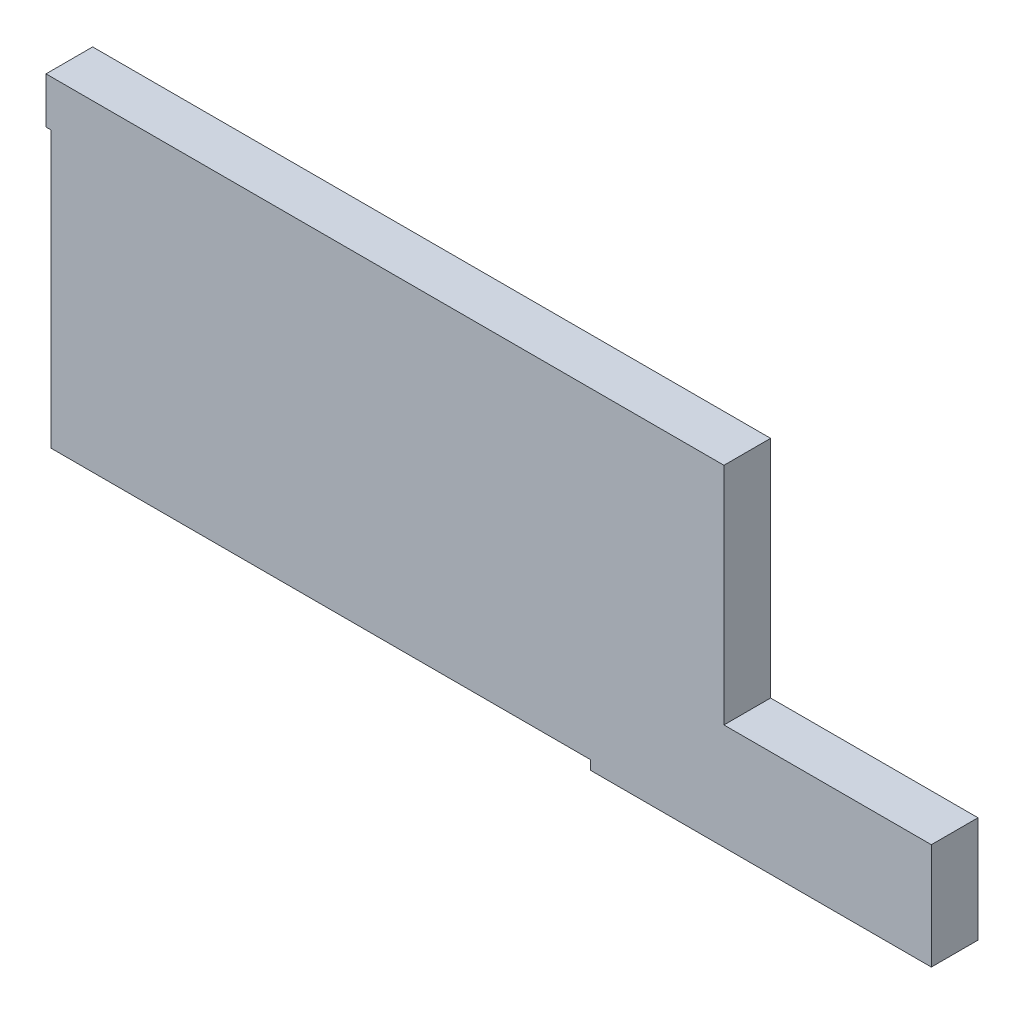
ISO-10303-21;
HEADER;
FILE_DESCRIPTION(('STEP AP214'),'2;1');
FILE_NAME('part.step','',(''),(''),'','','');
FILE_SCHEMA(('AUTOMOTIVE_DESIGN { 1 0 10303 214 1 1 1 1 }'));
ENDSEC;
DATA;
#1=APPLICATION_CONTEXT('core data for automotive mechanical design processes');
#2=APPLICATION_PROTOCOL_DEFINITION('international standard','automotive_design',2000,#1);
#3=PRODUCT_CONTEXT('',#1,'mechanical');
#4=PRODUCT('Part','Part','',(#3));
#5=PRODUCT_RELATED_PRODUCT_CATEGORY('part','',(#4));
#6=PRODUCT_DEFINITION_FORMATION('','',#4);
#7=PRODUCT_DEFINITION_CONTEXT('part definition',#1,'design');
#8=PRODUCT_DEFINITION('design','',#6,#7);
#9=PRODUCT_DEFINITION_SHAPE('','',#8);
#10=(LENGTH_UNIT() NAMED_UNIT(*) SI_UNIT(.MILLI.,.METRE.));
#11=(NAMED_UNIT(*) PLANE_ANGLE_UNIT() SI_UNIT($,.RADIAN.));
#12=(NAMED_UNIT(*) SI_UNIT($,.STERADIAN.) SOLID_ANGLE_UNIT());
#13=UNCERTAINTY_MEASURE_WITH_UNIT(LENGTH_MEASURE(1.E-05),#10,'distance_accuracy_value','');
#14=(GEOMETRIC_REPRESENTATION_CONTEXT(3) GLOBAL_UNCERTAINTY_ASSIGNED_CONTEXT((#13)) GLOBAL_UNIT_ASSIGNED_CONTEXT((#10,
#11,#12)) REPRESENTATION_CONTEXT('',''));
#15=CARTESIAN_POINT('',(0.,0.,0.));
#16=DIRECTION('',(0.,0.,1.));
#17=DIRECTION('',(1.,0.,0.));
#18=AXIS2_PLACEMENT_3D('',#15,#16,#17);
#19=CARTESIAN_POINT('',(146.,-14.1960000000021,-10.125));
#20=DIRECTION('',(0.,1.,0.));
#21=DIRECTION('',(-1.,0.,0.));
#22=AXIS2_PLACEMENT_3D('',#19,#20,#21);
#23=PLANE('',#22);
#24=DIRECTION('',(-1.,0.,0.));
#25=VECTOR('',#24,1.);
#26=CARTESIAN_POINT('',(146.,-14.1960000000021,0.));
#27=LINE('',#26,#25);
#28=CARTESIAN_POINT('',(191.,-14.1960000000021,0.));
#29=VERTEX_POINT('',#28);
#30=CARTESIAN_POINT('',(146.,-14.1960000000021,0.));
#31=VERTEX_POINT('',#30);
#32=EDGE_CURVE('E142',#29,#31,#27,.T.);
#33=ORIENTED_EDGE('',*,*,#32,.F.);
#34=DIRECTION('',(0.,0.,1.));
#35=VECTOR('',#34,1.);
#36=CARTESIAN_POINT('',(191.,-14.1960000000021,-10.125));
#37=LINE('',#36,#35);
#38=CARTESIAN_POINT('',(191.,-14.1960000000021,-10.125));
#39=VERTEX_POINT('',#38);
#40=EDGE_CURVE('E11',#39,#29,#37,.T.);
#41=ORIENTED_EDGE('',*,*,#40,.F.);
#42=DIRECTION('',(-1.,0.,0.));
#43=VECTOR('',#42,1.);
#44=CARTESIAN_POINT('',(146.,-14.1960000000021,-10.125));
#45=LINE('',#44,#43);
#46=CARTESIAN_POINT('',(146.,-14.1960000000021,-10.125));
#47=VERTEX_POINT('',#46);
#48=EDGE_CURVE('E168',#39,#47,#45,.T.);
#49=ORIENTED_EDGE('',*,*,#48,.T.);
#50=DIRECTION('',(0.,0.,1.));
#51=VECTOR('',#50,1.);
#52=CARTESIAN_POINT('',(146.,-14.1960000000021,-10.125));
#53=LINE('',#52,#51);
#54=EDGE_CURVE('E36',#47,#31,#53,.T.);
#55=ORIENTED_EDGE('',*,*,#54,.T.);
#56=EDGE_LOOP('',(#33,#41,#49,#55));
#57=FACE_BOUND('',#56,.T.);
#58=ADVANCED_FACE('F33',(#57),#23,.T.);
#59=CARTESIAN_POINT('',(191.,-14.1960000000021,-10.125));
#60=DIRECTION('',(1.,0.,0.));
#61=DIRECTION('',(0.,0.,-1.));
#62=AXIS2_PLACEMENT_3D('',#59,#60,#61);
#63=PLANE('',#62);
#64=DIRECTION('',(0.,1.,0.));
#65=VECTOR('',#64,1.);
#66=CARTESIAN_POINT('',(191.,-14.1960000000021,0.));
#67=LINE('',#66,#65);
#68=CARTESIAN_POINT('',(191.,-37.1960000000021,0.));
#69=VERTEX_POINT('',#68);
#70=EDGE_CURVE('E166',#69,#29,#67,.T.);
#71=ORIENTED_EDGE('',*,*,#70,.F.);
#72=DIRECTION('',(0.,0.,1.));
#73=VECTOR('',#72,1.);
#74=CARTESIAN_POINT('',(191.,-37.1960000000021,-10.125));
#75=LINE('',#74,#73);
#76=CARTESIAN_POINT('',(191.,-37.1960000000021,-10.125));
#77=VERTEX_POINT('',#76);
#78=EDGE_CURVE('E42',#77,#69,#75,.T.);
#79=ORIENTED_EDGE('',*,*,#78,.F.);
#80=DIRECTION('',(0.,1.,0.));
#81=VECTOR('',#80,1.);
#82=CARTESIAN_POINT('',(191.,-14.1960000000021,-10.125));
#83=LINE('',#82,#81);
#84=EDGE_CURVE('E132',#77,#39,#83,.T.);
#85=ORIENTED_EDGE('',*,*,#84,.T.);
#86=ORIENTED_EDGE('',*,*,#40,.T.);
#87=EDGE_LOOP('',(#71,#79,#85,#86));
#88=FACE_BOUND('',#87,.T.);
#89=ADVANCED_FACE('F184',(#88),#63,.T.);
#90=CARTESIAN_POINT('',(191.,-37.1960000000021,-10.125));
#91=DIRECTION('',(0.,-1.,0.));
#92=DIRECTION('',(0.,0.,-1.));
#93=AXIS2_PLACEMENT_3D('',#90,#91,#92);
#94=PLANE('',#93);
#95=DIRECTION('',(1.,0.,0.));
#96=VECTOR('',#95,1.);
#97=CARTESIAN_POINT('',(191.,-37.1960000000021,0.));
#98=LINE('',#97,#96);
#99=CARTESIAN_POINT('',(117.,-37.1960000000021,0.));
#100=VERTEX_POINT('',#99);
#101=EDGE_CURVE('E119',#100,#69,#98,.T.);
#102=ORIENTED_EDGE('',*,*,#101,.F.);
#103=DIRECTION('',(0.,0.,1.));
#104=VECTOR('',#103,1.);
#105=CARTESIAN_POINT('',(117.,-37.1960000000021,-10.125));
#106=LINE('',#105,#104);
#107=CARTESIAN_POINT('',(117.,-37.1960000000021,-10.125));
#108=VERTEX_POINT('',#107);
#109=EDGE_CURVE('E114',#108,#100,#106,.T.);
#110=ORIENTED_EDGE('',*,*,#109,.F.);
#111=DIRECTION('',(1.,0.,0.));
#112=VECTOR('',#111,1.);
#113=CARTESIAN_POINT('',(191.,-37.1960000000021,-10.125));
#114=LINE('',#113,#112);
#115=EDGE_CURVE('E117',#108,#77,#114,.T.);
#116=ORIENTED_EDGE('',*,*,#115,.T.);
#117=ORIENTED_EDGE('',*,*,#78,.T.);
#118=EDGE_LOOP('',(#102,#110,#116,#117));
#119=FACE_BOUND('',#118,.T.);
#120=ADVANCED_FACE('F116',(#119),#94,.T.);
#121=CARTESIAN_POINT('',(117.,-37.1960000000021,-10.125));
#122=DIRECTION('',(-1.,0.,0.));
#123=DIRECTION('',(0.,0.,1.));
#124=AXIS2_PLACEMENT_3D('',#121,#122,#123);
#125=PLANE('',#124);
#126=DIRECTION('',(0.,-1.,0.));
#127=VECTOR('',#126,1.);
#128=CARTESIAN_POINT('',(117.,-37.1960000000021,0.));
#129=LINE('',#128,#127);
#130=CARTESIAN_POINT('',(117.,-35.1960000000021,0.));
#131=VERTEX_POINT('',#130);
#132=EDGE_CURVE('E163',#131,#100,#129,.T.);
#133=ORIENTED_EDGE('',*,*,#132,.F.);
#134=DIRECTION('',(0.,0.,1.));
#135=VECTOR('',#134,1.);
#136=CARTESIAN_POINT('',(117.,-35.1960000000021,-10.125));
#137=LINE('',#136,#135);
#138=CARTESIAN_POINT('',(117.,-35.1960000000021,-10.125));
#139=VERTEX_POINT('',#138);
#140=EDGE_CURVE('E124',#139,#131,#137,.T.);
#141=ORIENTED_EDGE('',*,*,#140,.F.);
#142=DIRECTION('',(0.,-1.,0.));
#143=VECTOR('',#142,1.);
#144=CARTESIAN_POINT('',(117.,-37.1960000000021,-10.125));
#145=LINE('',#144,#143);
#146=EDGE_CURVE('E130',#139,#108,#145,.T.);
#147=ORIENTED_EDGE('',*,*,#146,.T.);
#148=ORIENTED_EDGE('',*,*,#109,.T.);
#149=EDGE_LOOP('',(#133,#141,#147,#148));
#150=FACE_BOUND('',#149,.T.);
#151=ADVANCED_FACE('F134',(#150),#125,.T.);
#152=CARTESIAN_POINT('',(117.,-35.1960000000021,-10.125));
#153=DIRECTION('',(0.,-1.,0.));
#154=DIRECTION('',(0.,0.,-1.));
#155=AXIS2_PLACEMENT_3D('',#152,#153,#154);
#156=PLANE('',#155);
#157=DIRECTION('',(1.,0.,0.));
#158=VECTOR('',#157,1.);
#159=CARTESIAN_POINT('',(117.,-35.1960000000021,0.));
#160=LINE('',#159,#158);
#161=CARTESIAN_POINT('',(0.,-35.1960000000021,0.));
#162=VERTEX_POINT('',#161);
#163=EDGE_CURVE('E160',#162,#131,#160,.T.);
#164=ORIENTED_EDGE('',*,*,#163,.F.);
#165=DIRECTION('',(0.,0.,1.));
#166=VECTOR('',#165,1.);
#167=CARTESIAN_POINT('',(0.,-35.1960000000021,-10.125));
#168=LINE('',#167,#166);
#169=CARTESIAN_POINT('',(0.,-35.1960000000021,-10.125));
#170=VERTEX_POINT('',#169);
#171=EDGE_CURVE('E172',#170,#162,#168,.T.);
#172=ORIENTED_EDGE('',*,*,#171,.F.);
#173=DIRECTION('',(1.,0.,0.));
#174=VECTOR('',#173,1.);
#175=CARTESIAN_POINT('',(117.,-35.1960000000021,-10.125));
#176=LINE('',#175,#174);
#177=EDGE_CURVE('E135',#170,#139,#176,.T.);
#178=ORIENTED_EDGE('',*,*,#177,.T.);
#179=ORIENTED_EDGE('',*,*,#140,.T.);
#180=EDGE_LOOP('',(#164,#172,#178,#179));
#181=FACE_BOUND('',#180,.T.);
#182=ADVANCED_FACE('F197',(#181),#156,.T.);
#183=CARTESIAN_POINT('',(0.,-35.1960000000021,-10.125));
#184=DIRECTION('',(-1.,0.,0.));
#185=DIRECTION('',(0.,-1.,0.));
#186=AXIS2_PLACEMENT_3D('',#183,#184,#185);
#187=PLANE('',#186);
#188=DIRECTION('',(0.,-1.,0.));
#189=VECTOR('',#188,1.);
#190=CARTESIAN_POINT('',(0.,-35.1960000000021,0.));
#191=LINE('',#190,#189);
#192=CARTESIAN_POINT('',(0.,24.6039999999979,0.));
#193=VERTEX_POINT('',#192);
#194=EDGE_CURVE('E157',#193,#162,#191,.T.);
#195=ORIENTED_EDGE('',*,*,#194,.F.);
#196=DIRECTION('',(0.,0.,1.));
#197=VECTOR('',#196,1.);
#198=CARTESIAN_POINT('',(0.,24.6039999999979,-10.125));
#199=LINE('',#198,#197);
#200=CARTESIAN_POINT('',(0.,24.6039999999979,-10.125));
#201=VERTEX_POINT('',#200);
#202=EDGE_CURVE('E174',#201,#193,#199,.T.);
#203=ORIENTED_EDGE('',*,*,#202,.F.);
#204=DIRECTION('',(0.,-1.,0.));
#205=VECTOR('',#204,1.);
#206=CARTESIAN_POINT('',(0.,-35.1960000000021,-10.125));
#207=LINE('',#206,#205);
#208=EDGE_CURVE('E137',#201,#170,#207,.T.);
#209=ORIENTED_EDGE('',*,*,#208,.T.);
#210=ORIENTED_EDGE('',*,*,#171,.T.);
#211=EDGE_LOOP('',(#195,#203,#209,#210));
#212=FACE_BOUND('',#211,.T.);
#213=ADVANCED_FACE('F200',(#212),#187,.T.);
#214=CARTESIAN_POINT('',(0.,24.6039999999979,-10.125));
#215=DIRECTION('',(0.,-1.,0.));
#216=DIRECTION('',(0.,0.,-1.));
#217=AXIS2_PLACEMENT_3D('',#214,#215,#216);
#218=PLANE('',#217);
#219=DIRECTION('',(1.,0.,0.));
#220=VECTOR('',#219,1.);
#221=CARTESIAN_POINT('',(0.,24.6039999999979,0.));
#222=LINE('',#221,#220);
#223=CARTESIAN_POINT('',(-1.10000000000006,24.6039999999979,0.));
#224=VERTEX_POINT('',#223);
#225=EDGE_CURVE('E154',#224,#193,#222,.T.);
#226=ORIENTED_EDGE('',*,*,#225,.F.);
#227=DIRECTION('',(0.,0.,1.));
#228=VECTOR('',#227,1.);
#229=CARTESIAN_POINT('',(-1.10000000000006,24.6039999999979,-10.125));
#230=LINE('',#229,#228);
#231=CARTESIAN_POINT('',(-1.10000000000006,24.6039999999979,-10.125));
#232=VERTEX_POINT('',#231);
#233=EDGE_CURVE('E176',#232,#224,#230,.T.);
#234=ORIENTED_EDGE('',*,*,#233,.F.);
#235=DIRECTION('',(1.,0.,0.));
#236=VECTOR('',#235,1.);
#237=CARTESIAN_POINT('',(0.,24.6039999999979,-10.125));
#238=LINE('',#237,#236);
#239=EDGE_CURVE('E299',#232,#201,#238,.T.);
#240=ORIENTED_EDGE('',*,*,#239,.T.);
#241=ORIENTED_EDGE('',*,*,#202,.T.);
#242=EDGE_LOOP('',(#226,#234,#240,#241));
#243=FACE_BOUND('',#242,.T.);
#244=ADVANCED_FACE('F204',(#243),#218,.T.);
#245=CARTESIAN_POINT('',(-1.10000000000006,24.6039999999979,-10.125));
#246=DIRECTION('',(-1.,0.,0.));
#247=DIRECTION('',(0.,0.,1.));
#248=AXIS2_PLACEMENT_3D('',#245,#246,#247);
#249=PLANE('',#248);
#250=DIRECTION('',(0.,-1.,0.));
#251=VECTOR('',#250,1.);
#252=CARTESIAN_POINT('',(-1.10000000000006,24.6039999999979,0.));
#253=LINE('',#252,#251);
#254=CARTESIAN_POINT('',(-1.10000000000006,34.6039999999979,0.));
#255=VERTEX_POINT('',#254);
#256=EDGE_CURVE('E151',#255,#224,#253,.T.);
#257=ORIENTED_EDGE('',*,*,#256,.F.);
#258=DIRECTION('',(0.,0.,1.));
#259=VECTOR('',#258,1.);
#260=CARTESIAN_POINT('',(-1.10000000000006,34.6039999999979,-10.125));
#261=LINE('',#260,#259);
#262=CARTESIAN_POINT('',(-1.10000000000006,34.6039999999979,-10.125));
#263=VERTEX_POINT('',#262);
#264=EDGE_CURVE('E178',#263,#255,#261,.T.);
#265=ORIENTED_EDGE('',*,*,#264,.F.);
#266=DIRECTION('',(0.,-1.,0.));
#267=VECTOR('',#266,1.);
#268=CARTESIAN_POINT('',(-1.10000000000006,24.6039999999979,-10.125));
#269=LINE('',#268,#267);
#270=EDGE_CURVE('E295',#263,#232,#269,.T.);
#271=ORIENTED_EDGE('',*,*,#270,.T.);
#272=ORIENTED_EDGE('',*,*,#233,.T.);
#273=EDGE_LOOP('',(#257,#265,#271,#272));
#274=FACE_BOUND('',#273,.T.);
#275=ADVANCED_FACE('F208',(#274),#249,.T.);
#276=CARTESIAN_POINT('',(-1.10000000000006,34.6039999999979,-10.125));
#277=DIRECTION('',(0.,1.,0.));
#278=DIRECTION('',(0.,0.,1.));
#279=AXIS2_PLACEMENT_3D('',#276,#277,#278);
#280=PLANE('',#279);
#281=DIRECTION('',(-1.,0.,0.));
#282=VECTOR('',#281,1.);
#283=CARTESIAN_POINT('',(-1.10000000000006,34.6039999999979,0.));
#284=LINE('',#283,#282);
#285=CARTESIAN_POINT('',(146.,34.6039999999979,0.));
#286=VERTEX_POINT('',#285);
#287=EDGE_CURVE('E148',#286,#255,#284,.T.);
#288=ORIENTED_EDGE('',*,*,#287,.F.);
#289=DIRECTION('',(0.,0.,1.));
#290=VECTOR('',#289,1.);
#291=CARTESIAN_POINT('',(146.,34.6039999999979,-10.125));
#292=LINE('',#291,#290);
#293=CARTESIAN_POINT('',(146.,34.6039999999979,-10.125));
#294=VERTEX_POINT('',#293);
#295=EDGE_CURVE('E179',#294,#286,#292,.T.);
#296=ORIENTED_EDGE('',*,*,#295,.F.);
#297=DIRECTION('',(-1.,0.,0.));
#298=VECTOR('',#297,1.);
#299=CARTESIAN_POINT('',(-1.10000000000006,34.6039999999979,-10.125));
#300=LINE('',#299,#298);
#301=EDGE_CURVE('E306',#294,#263,#300,.T.);
#302=ORIENTED_EDGE('',*,*,#301,.T.);
#303=ORIENTED_EDGE('',*,*,#264,.T.);
#304=EDGE_LOOP('',(#288,#296,#302,#303));
#305=FACE_BOUND('',#304,.T.);
#306=ADVANCED_FACE('F212',(#305),#280,.T.);
#307=CARTESIAN_POINT('',(146.,34.6039999999979,-10.125));
#308=DIRECTION('',(1.,0.,0.));
#309=DIRECTION('',(0.,0.,-1.));
#310=AXIS2_PLACEMENT_3D('',#307,#308,#309);
#311=PLANE('',#310);
#312=DIRECTION('',(0.,1.,0.));
#313=VECTOR('',#312,1.);
#314=CARTESIAN_POINT('',(146.,34.6039999999979,0.));
#315=LINE('',#314,#313);
#316=EDGE_CURVE('E145',#31,#286,#315,.T.);
#317=ORIENTED_EDGE('',*,*,#316,.F.);
#318=ORIENTED_EDGE('',*,*,#54,.F.);
#319=DIRECTION('',(0.,1.,0.));
#320=VECTOR('',#319,1.);
#321=CARTESIAN_POINT('',(146.,34.6039999999979,-10.125));
#322=LINE('',#321,#320);
#323=EDGE_CURVE('E308',#47,#294,#322,.T.);
#324=ORIENTED_EDGE('',*,*,#323,.T.);
#325=ORIENTED_EDGE('',*,*,#295,.T.);
#326=EDGE_LOOP('',(#317,#318,#324,#325));
#327=FACE_BOUND('',#326,.T.);
#328=ADVANCED_FACE('F181',(#327),#311,.T.);
#329=CARTESIAN_POINT('',(0.,0.,-10.125));
#330=DIRECTION('',(0.,0.,-1.));
#331=DIRECTION('',(-1.,0.,0.));
#332=AXIS2_PLACEMENT_3D('',#329,#330,#331);
#333=PLANE('',#332);
#334=ORIENTED_EDGE('',*,*,#48,.F.);
#335=ORIENTED_EDGE('',*,*,#84,.F.);
#336=ORIENTED_EDGE('',*,*,#115,.F.);
#337=ORIENTED_EDGE('',*,*,#146,.F.);
#338=ORIENTED_EDGE('',*,*,#177,.F.);
#339=ORIENTED_EDGE('',*,*,#208,.F.);
#340=ORIENTED_EDGE('',*,*,#239,.F.);
#341=ORIENTED_EDGE('',*,*,#270,.F.);
#342=ORIENTED_EDGE('',*,*,#301,.F.);
#343=ORIENTED_EDGE('',*,*,#323,.F.);
#344=EDGE_LOOP('',(#334,#335,#336,#337,#338,#339,#340,#341,#342,#343));
#345=FACE_BOUND('',#344,.T.);
#346=ADVANCED_FACE('F128',(#345),#333,.T.);
#347=CARTESIAN_POINT('',(0.,0.,0.));
#348=DIRECTION('',(0.,0.,-1.));
#349=DIRECTION('',(-1.,0.,0.));
#350=AXIS2_PLACEMENT_3D('',#347,#348,#349);
#351=PLANE('',#350);
#352=ORIENTED_EDGE('',*,*,#32,.T.);
#353=ORIENTED_EDGE('',*,*,#316,.T.);
#354=ORIENTED_EDGE('',*,*,#287,.T.);
#355=ORIENTED_EDGE('',*,*,#256,.T.);
#356=ORIENTED_EDGE('',*,*,#225,.T.);
#357=ORIENTED_EDGE('',*,*,#194,.T.);
#358=ORIENTED_EDGE('',*,*,#163,.T.);
#359=ORIENTED_EDGE('',*,*,#132,.T.);
#360=ORIENTED_EDGE('',*,*,#101,.T.);
#361=ORIENTED_EDGE('',*,*,#70,.T.);
#362=EDGE_LOOP('',(#352,#353,#354,#355,#356,#357,#358,#359,#360,#361));
#363=FACE_BOUND('',#362,.T.);
#364=ADVANCED_FACE('F183',(#363),#351,.F.);
#365=CLOSED_SHELL('',(#58,#89,#120,#151,#182,#213,#244,#275,#306,#328,#346,#364));
#366=MANIFOLD_SOLID_BREP('B2',#365);
#367=ADVANCED_BREP_SHAPE_REPRESENTATION('',(#18,#366),#14);
#368=SHAPE_DEFINITION_REPRESENTATION(#9,#367);
ENDSEC;
END-ISO-10303-21;
